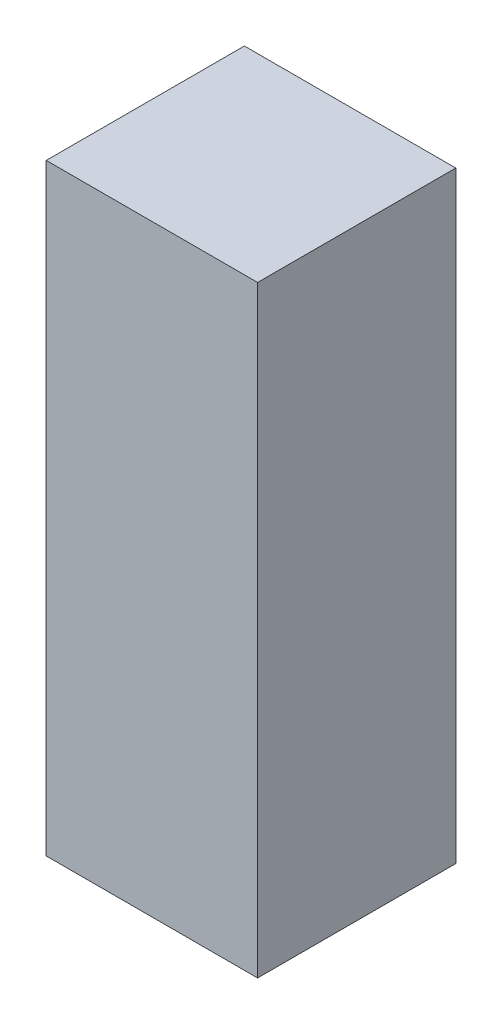
ISO-10303-21;
HEADER;
FILE_DESCRIPTION(('STEP AP214'),'2;1');
FILE_NAME('part.step','',(''),(''),'','','');
FILE_SCHEMA(('AUTOMOTIVE_DESIGN { 1 0 10303 214 1 1 1 1 }'));
ENDSEC;
DATA;
#1=APPLICATION_CONTEXT('core data for automotive mechanical design processes');
#2=APPLICATION_PROTOCOL_DEFINITION('international standard','automotive_design',2000,#1);
#3=PRODUCT_CONTEXT('',#1,'mechanical');
#4=PRODUCT('Part','Part','',(#3));
#5=PRODUCT_RELATED_PRODUCT_CATEGORY('part','',(#4));
#6=PRODUCT_DEFINITION_FORMATION('','',#4);
#7=PRODUCT_DEFINITION_CONTEXT('part definition',#1,'design');
#8=PRODUCT_DEFINITION('design','',#6,#7);
#9=PRODUCT_DEFINITION_SHAPE('','',#8);
#10=(LENGTH_UNIT() NAMED_UNIT(*) SI_UNIT(.MILLI.,.METRE.));
#11=(NAMED_UNIT(*) PLANE_ANGLE_UNIT() SI_UNIT($,.RADIAN.));
#12=(NAMED_UNIT(*) SI_UNIT($,.STERADIAN.) SOLID_ANGLE_UNIT());
#13=UNCERTAINTY_MEASURE_WITH_UNIT(LENGTH_MEASURE(1.E-05),#10,'distance_accuracy_value','');
#14=(GEOMETRIC_REPRESENTATION_CONTEXT(3) GLOBAL_UNCERTAINTY_ASSIGNED_CONTEXT((#13)) GLOBAL_UNIT_ASSIGNED_CONTEXT((#10,
#11,#12)) REPRESENTATION_CONTEXT('',''));
#15=CARTESIAN_POINT('',(0.,0.,0.));
#16=DIRECTION('',(0.,0.,1.));
#17=DIRECTION('',(1.,0.,0.));
#18=AXIS2_PLACEMENT_3D('',#15,#16,#17);
#19=CARTESIAN_POINT('',(24.,136.8,22.5));
#20=DIRECTION('',(-1.,0.,0.));
#21=DIRECTION('',(0.,0.,1.));
#22=AXIS2_PLACEMENT_3D('',#19,#20,#21);
#23=PLANE('',#22);
#24=DIRECTION('',(0.,0.,-1.));
#25=VECTOR('',#24,1.);
#26=CARTESIAN_POINT('',(24.,0.,22.5));
#27=LINE('',#26,#25);
#28=CARTESIAN_POINT('',(24.,0.,22.5));
#29=VERTEX_POINT('',#28);
#30=CARTESIAN_POINT('',(24.,0.,-22.5));
#31=VERTEX_POINT('',#30);
#32=EDGE_CURVE('E113',#29,#31,#27,.T.);
#33=ORIENTED_EDGE('',*,*,#32,.T.);
#34=DIRECTION('',(0.,-1.,0.));
#35=VECTOR('',#34,1.);
#36=CARTESIAN_POINT('',(24.,136.8,-22.5));
#37=LINE('',#36,#35);
#38=CARTESIAN_POINT('',(24.,136.8,-22.5));
#39=VERTEX_POINT('',#38);
#40=EDGE_CURVE('E11',#39,#31,#37,.T.);
#41=ORIENTED_EDGE('',*,*,#40,.F.);
#42=DIRECTION('',(0.,0.,-1.));
#43=VECTOR('',#42,1.);
#44=CARTESIAN_POINT('',(24.,136.8,22.5));
#45=LINE('',#44,#43);
#46=CARTESIAN_POINT('',(24.,136.8,22.5));
#47=VERTEX_POINT('',#46);
#48=EDGE_CURVE('E97',#47,#39,#45,.T.);
#49=ORIENTED_EDGE('',*,*,#48,.F.);
#50=DIRECTION('',(0.,-1.,0.));
#51=VECTOR('',#50,1.);
#52=CARTESIAN_POINT('',(24.,136.8,22.5));
#53=LINE('',#52,#51);
#54=EDGE_CURVE('E109',#47,#29,#53,.T.);
#55=ORIENTED_EDGE('',*,*,#54,.T.);
#56=EDGE_LOOP('',(#33,#41,#49,#55));
#57=FACE_BOUND('',#56,.T.);
#58=ADVANCED_FACE('F45',(#57),#23,.F.);
#59=CARTESIAN_POINT('',(-24.,136.8,-22.5));
#60=DIRECTION('',(0.,0.,1.));
#61=DIRECTION('',(1.,0.,0.));
#62=AXIS2_PLACEMENT_3D('',#59,#60,#61);
#63=PLANE('',#62);
#64=DIRECTION('',(-1.,0.,0.));
#65=VECTOR('',#64,1.);
#66=CARTESIAN_POINT('',(-24.,0.,-22.5));
#67=LINE('',#66,#65);
#68=CARTESIAN_POINT('',(-24.,0.,-22.5));
#69=VERTEX_POINT('',#68);
#70=EDGE_CURVE('E102',#31,#69,#67,.T.);
#71=ORIENTED_EDGE('',*,*,#70,.T.);
#72=DIRECTION('',(0.,-1.,0.));
#73=VECTOR('',#72,1.);
#74=CARTESIAN_POINT('',(-24.,136.8,-22.5));
#75=LINE('',#74,#73);
#76=CARTESIAN_POINT('',(-24.,136.8,-22.5));
#77=VERTEX_POINT('',#76);
#78=EDGE_CURVE('E54',#77,#69,#75,.T.);
#79=ORIENTED_EDGE('',*,*,#78,.F.);
#80=DIRECTION('',(-1.,0.,0.));
#81=VECTOR('',#80,1.);
#82=CARTESIAN_POINT('',(-24.,136.8,-22.5));
#83=LINE('',#82,#81);
#84=EDGE_CURVE('E92',#39,#77,#83,.T.);
#85=ORIENTED_EDGE('',*,*,#84,.F.);
#86=ORIENTED_EDGE('',*,*,#40,.T.);
#87=EDGE_LOOP('',(#71,#79,#85,#86));
#88=FACE_BOUND('',#87,.T.);
#89=ADVANCED_FACE('F101',(#88),#63,.F.);
#90=CARTESIAN_POINT('',(-24.,136.8,22.5));
#91=DIRECTION('',(1.,0.,0.));
#92=DIRECTION('',(0.,0.,-1.));
#93=AXIS2_PLACEMENT_3D('',#90,#91,#92);
#94=PLANE('',#93);
#95=DIRECTION('',(0.,0.,1.));
#96=VECTOR('',#95,1.);
#97=CARTESIAN_POINT('',(-24.,0.,22.5));
#98=LINE('',#97,#96);
#99=CARTESIAN_POINT('',(-24.,0.,22.5));
#100=VERTEX_POINT('',#99);
#101=EDGE_CURVE('E79',#69,#100,#98,.T.);
#102=ORIENTED_EDGE('',*,*,#101,.T.);
#103=DIRECTION('',(0.,-1.,0.));
#104=VECTOR('',#103,1.);
#105=CARTESIAN_POINT('',(-24.,136.8,22.5));
#106=LINE('',#105,#104);
#107=CARTESIAN_POINT('',(-24.,136.8,22.5));
#108=VERTEX_POINT('',#107);
#109=EDGE_CURVE('E104',#108,#100,#106,.T.);
#110=ORIENTED_EDGE('',*,*,#109,.F.);
#111=DIRECTION('',(0.,0.,1.));
#112=VECTOR('',#111,1.);
#113=CARTESIAN_POINT('',(-24.,136.8,22.5));
#114=LINE('',#113,#112);
#115=EDGE_CURVE('E95',#77,#108,#114,.T.);
#116=ORIENTED_EDGE('',*,*,#115,.F.);
#117=ORIENTED_EDGE('',*,*,#78,.T.);
#118=EDGE_LOOP('',(#102,#110,#116,#117));
#119=FACE_BOUND('',#118,.T.);
#120=ADVANCED_FACE('F105',(#119),#94,.F.);
#121=CARTESIAN_POINT('',(-24.,136.8,22.5));
#122=DIRECTION('',(0.,0.,-1.));
#123=DIRECTION('',(-1.,0.,0.));
#124=AXIS2_PLACEMENT_3D('',#121,#122,#123);
#125=PLANE('',#124);
#126=DIRECTION('',(1.,0.,0.));
#127=VECTOR('',#126,1.);
#128=CARTESIAN_POINT('',(-24.,0.,22.5));
#129=LINE('',#128,#127);
#130=EDGE_CURVE('E85',#100,#29,#129,.T.);
#131=ORIENTED_EDGE('',*,*,#130,.T.);
#132=ORIENTED_EDGE('',*,*,#54,.F.);
#133=DIRECTION('',(1.,0.,0.));
#134=VECTOR('',#133,1.);
#135=CARTESIAN_POINT('',(-24.,136.8,22.5));
#136=LINE('',#135,#134);
#137=EDGE_CURVE('E62',#108,#47,#136,.T.);
#138=ORIENTED_EDGE('',*,*,#137,.F.);
#139=ORIENTED_EDGE('',*,*,#109,.T.);
#140=EDGE_LOOP('',(#131,#132,#138,#139));
#141=FACE_BOUND('',#140,.T.);
#142=ADVANCED_FACE('F126',(#141),#125,.F.);
#143=CARTESIAN_POINT('',(0.,136.8,0.));
#144=DIRECTION('',(0.,-1.,0.));
#145=DIRECTION('',(0.,0.,-1.));
#146=AXIS2_PLACEMENT_3D('',#143,#144,#145);
#147=PLANE('',#146);
#148=ORIENTED_EDGE('',*,*,#48,.T.);
#149=ORIENTED_EDGE('',*,*,#84,.T.);
#150=ORIENTED_EDGE('',*,*,#115,.T.);
#151=ORIENTED_EDGE('',*,*,#137,.T.);
#152=EDGE_LOOP('',(#148,#149,#150,#151));
#153=FACE_BOUND('',#152,.T.);
#154=ADVANCED_FACE('F93',(#153),#147,.F.);
#155=CARTESIAN_POINT('',(0.,0.,0.));
#156=DIRECTION('',(0.,-1.,0.));
#157=DIRECTION('',(0.,0.,-1.));
#158=AXIS2_PLACEMENT_3D('',#155,#156,#157);
#159=PLANE('',#158);
#160=ORIENTED_EDGE('',*,*,#32,.F.);
#161=ORIENTED_EDGE('',*,*,#130,.F.);
#162=ORIENTED_EDGE('',*,*,#101,.F.);
#163=ORIENTED_EDGE('',*,*,#70,.F.);
#164=EDGE_LOOP('',(#160,#161,#162,#163));
#165=FACE_BOUND('',#164,.T.);
#166=ADVANCED_FACE('F129',(#165),#159,.T.);
#167=CLOSED_SHELL('',(#58,#89,#120,#142,#154,#166));
#168=MANIFOLD_SOLID_BREP('B2',#167);
#169=ADVANCED_BREP_SHAPE_REPRESENTATION('',(#18,#168),#14);
#170=SHAPE_DEFINITION_REPRESENTATION(#9,#169);
ENDSEC;
END-ISO-10303-21;
